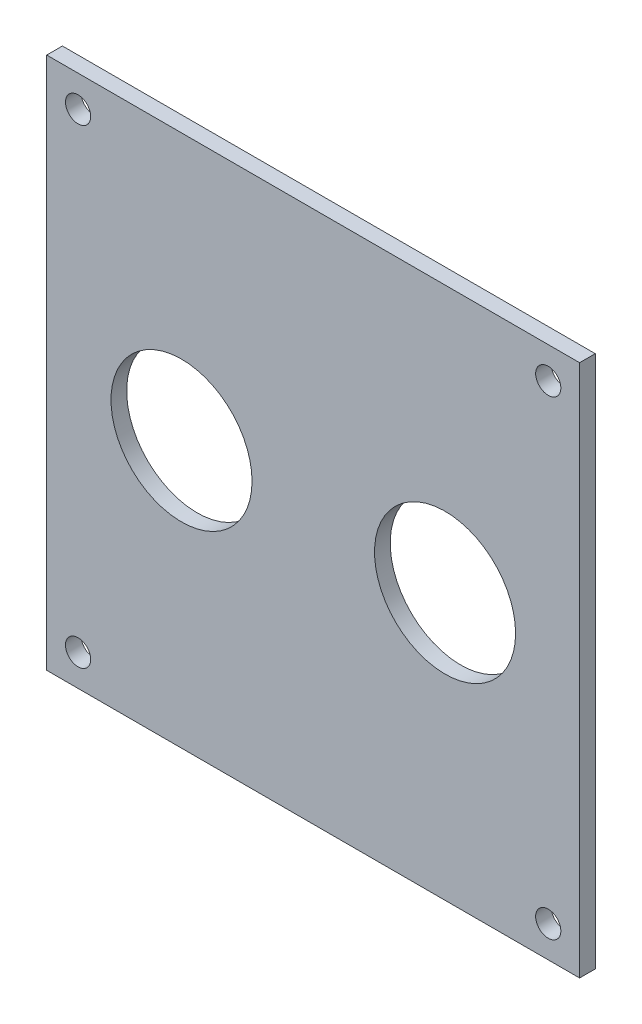
ISO-10303-21;
HEADER;
FILE_DESCRIPTION(('STEP AP214'),'2;1');
FILE_NAME('part.step','',(''),(''),'','','');
FILE_SCHEMA(('AUTOMOTIVE_DESIGN { 1 0 10303 214 1 1 1 1 }'));
ENDSEC;
DATA;
#1=APPLICATION_CONTEXT('core data for automotive mechanical design processes');
#2=APPLICATION_PROTOCOL_DEFINITION('international standard','automotive_design',2000,#1);
#3=PRODUCT_CONTEXT('',#1,'mechanical');
#4=PRODUCT('Part','Part','',(#3));
#5=PRODUCT_RELATED_PRODUCT_CATEGORY('part','',(#4));
#6=PRODUCT_DEFINITION_FORMATION('','',#4);
#7=PRODUCT_DEFINITION_CONTEXT('part definition',#1,'design');
#8=PRODUCT_DEFINITION('design','',#6,#7);
#9=PRODUCT_DEFINITION_SHAPE('','',#8);
#10=(LENGTH_UNIT() NAMED_UNIT(*) SI_UNIT(.MILLI.,.METRE.));
#11=(NAMED_UNIT(*) PLANE_ANGLE_UNIT() SI_UNIT($,.RADIAN.));
#12=(NAMED_UNIT(*) SI_UNIT($,.STERADIAN.) SOLID_ANGLE_UNIT());
#13=UNCERTAINTY_MEASURE_WITH_UNIT(LENGTH_MEASURE(1.E-05),#10,'distance_accuracy_value','');
#14=(GEOMETRIC_REPRESENTATION_CONTEXT(3) GLOBAL_UNCERTAINTY_ASSIGNED_CONTEXT((#13)) GLOBAL_UNIT_ASSIGNED_CONTEXT((#10,
#11,#12)) REPRESENTATION_CONTEXT('',''));
#15=CARTESIAN_POINT('',(0.,0.,0.));
#16=DIRECTION('',(0.,0.,1.));
#17=DIRECTION('',(1.,0.,0.));
#18=AXIS2_PLACEMENT_3D('',#15,#16,#17);
#19=CARTESIAN_POINT('',(0.,0.,3.175));
#20=DIRECTION('',(1.,0.,0.));
#21=DIRECTION('',(0.,0.,-1.));
#22=AXIS2_PLACEMENT_3D('',#19,#20,#21);
#23=PLANE('',#22);
#24=DIRECTION('',(0.,-1.,0.));
#25=VECTOR('',#24,1.);
#26=CARTESIAN_POINT('',(0.,0.,0.));
#27=LINE('',#26,#25);
#28=CARTESIAN_POINT('',(0.,107.95,0.));
#29=VERTEX_POINT('',#28);
#30=CARTESIAN_POINT('',(0.,0.,0.));
#31=VERTEX_POINT('',#30);
#32=EDGE_CURVE('E95',#29,#31,#27,.T.);
#33=ORIENTED_EDGE('',*,*,#32,.T.);
#34=DIRECTION('',(0.,0.,-1.));
#35=VECTOR('',#34,1.);
#36=CARTESIAN_POINT('',(0.,0.,3.175));
#37=LINE('',#36,#35);
#38=CARTESIAN_POINT('',(0.,0.,3.175));
#39=VERTEX_POINT('',#38);
#40=EDGE_CURVE('E11',#39,#31,#37,.T.);
#41=ORIENTED_EDGE('',*,*,#40,.F.);
#42=DIRECTION('',(0.,-1.,0.));
#43=VECTOR('',#42,1.);
#44=CARTESIAN_POINT('',(0.,0.,3.175));
#45=LINE('',#44,#43);
#46=CARTESIAN_POINT('',(0.,107.95,3.175));
#47=VERTEX_POINT('',#46);
#48=EDGE_CURVE('E83',#47,#39,#45,.T.);
#49=ORIENTED_EDGE('',*,*,#48,.F.);
#50=DIRECTION('',(0.,0.,-1.));
#51=VECTOR('',#50,1.);
#52=CARTESIAN_POINT('',(0.,107.95,3.175));
#53=LINE('',#52,#51);
#54=EDGE_CURVE('E91',#47,#29,#53,.T.);
#55=ORIENTED_EDGE('',*,*,#54,.T.);
#56=EDGE_LOOP('',(#33,#41,#49,#55));
#57=FACE_BOUND('',#56,.T.);
#58=ADVANCED_FACE('F32',(#57),#23,.F.);
#59=CARTESIAN_POINT('',(0.,0.,3.175));
#60=DIRECTION('',(0.,1.,0.));
#61=DIRECTION('',(0.,0.,1.));
#62=AXIS2_PLACEMENT_3D('',#59,#60,#61);
#63=PLANE('',#62);
#64=DIRECTION('',(1.,0.,0.));
#65=VECTOR('',#64,1.);
#66=CARTESIAN_POINT('',(0.,0.,0.));
#67=LINE('',#66,#65);
#68=CARTESIAN_POINT('',(107.95,0.,0.));
#69=VERTEX_POINT('',#68);
#70=EDGE_CURVE('E87',#31,#69,#67,.T.);
#71=ORIENTED_EDGE('',*,*,#70,.T.);
#72=DIRECTION('',(0.,0.,-1.));
#73=VECTOR('',#72,1.);
#74=CARTESIAN_POINT('',(107.95,0.,3.175));
#75=LINE('',#74,#73);
#76=CARTESIAN_POINT('',(107.95,0.,3.175));
#77=VERTEX_POINT('',#76);
#78=EDGE_CURVE('E40',#77,#69,#75,.T.);
#79=ORIENTED_EDGE('',*,*,#78,.F.);
#80=DIRECTION('',(1.,0.,0.));
#81=VECTOR('',#80,1.);
#82=CARTESIAN_POINT('',(0.,0.,3.175));
#83=LINE('',#82,#81);
#84=EDGE_CURVE('E78',#39,#77,#83,.T.);
#85=ORIENTED_EDGE('',*,*,#84,.F.);
#86=ORIENTED_EDGE('',*,*,#40,.T.);
#87=EDGE_LOOP('',(#71,#79,#85,#86));
#88=FACE_BOUND('',#87,.T.);
#89=ADVANCED_FACE('F86',(#88),#63,.F.);
#90=CARTESIAN_POINT('',(107.95,0.,3.175));
#91=DIRECTION('',(-1.,0.,0.));
#92=DIRECTION('',(0.,0.,1.));
#93=AXIS2_PLACEMENT_3D('',#90,#91,#92);
#94=PLANE('',#93);
#95=DIRECTION('',(0.,1.,0.));
#96=VECTOR('',#95,1.);
#97=CARTESIAN_POINT('',(107.95,0.,0.));
#98=LINE('',#97,#96);
#99=CARTESIAN_POINT('',(107.95,107.95,0.));
#100=VERTEX_POINT('',#99);
#101=EDGE_CURVE('E65',#69,#100,#98,.T.);
#102=ORIENTED_EDGE('',*,*,#101,.T.);
#103=DIRECTION('',(0.,0.,-1.));
#104=VECTOR('',#103,1.);
#105=CARTESIAN_POINT('',(107.95,107.95,3.175));
#106=LINE('',#105,#104);
#107=CARTESIAN_POINT('',(107.95,107.95,3.175));
#108=VERTEX_POINT('',#107);
#109=EDGE_CURVE('E88',#108,#100,#106,.T.);
#110=ORIENTED_EDGE('',*,*,#109,.F.);
#111=DIRECTION('',(0.,1.,0.));
#112=VECTOR('',#111,1.);
#113=CARTESIAN_POINT('',(107.95,0.,3.175));
#114=LINE('',#113,#112);
#115=EDGE_CURVE('E81',#77,#108,#114,.T.);
#116=ORIENTED_EDGE('',*,*,#115,.F.);
#117=ORIENTED_EDGE('',*,*,#78,.T.);
#118=EDGE_LOOP('',(#102,#110,#116,#117));
#119=FACE_BOUND('',#118,.T.);
#120=ADVANCED_FACE('F89',(#119),#94,.F.);
#121=CARTESIAN_POINT('',(0.,107.95,3.175));
#122=DIRECTION('',(0.,-1.,0.));
#123=DIRECTION('',(0.,0.,-1.));
#124=AXIS2_PLACEMENT_3D('',#121,#122,#123);
#125=PLANE('',#124);
#126=DIRECTION('',(-1.,0.,0.));
#127=VECTOR('',#126,1.);
#128=CARTESIAN_POINT('',(0.,107.95,0.));
#129=LINE('',#128,#127);
#130=EDGE_CURVE('E71',#100,#29,#129,.T.);
#131=ORIENTED_EDGE('',*,*,#130,.T.);
#132=ORIENTED_EDGE('',*,*,#54,.F.);
#133=DIRECTION('',(-1.,0.,0.));
#134=VECTOR('',#133,1.);
#135=CARTESIAN_POINT('',(0.,107.95,3.175));
#136=LINE('',#135,#134);
#137=EDGE_CURVE('E48',#108,#47,#136,.T.);
#138=ORIENTED_EDGE('',*,*,#137,.F.);
#139=ORIENTED_EDGE('',*,*,#109,.T.);
#140=EDGE_LOOP('',(#131,#132,#138,#139));
#141=FACE_BOUND('',#140,.T.);
#142=ADVANCED_FACE('F103',(#141),#125,.F.);
#143=CARTESIAN_POINT('',(0.,0.,3.175));
#144=DIRECTION('',(0.,0.,-1.));
#145=DIRECTION('',(-1.,0.,0.));
#146=AXIS2_PLACEMENT_3D('',#143,#144,#145);
#147=PLANE('',#146);
#148=CARTESIAN_POINT('',(80.6958,53.975,3.175));
#149=DIRECTION('',(0.,0.,1.));
#150=DIRECTION('',(1.,0.,0.));
#151=AXIS2_PLACEMENT_3D('',#148,#149,#150);
#152=CIRCLE('',#151,14.2875);
#153=CARTESIAN_POINT('',(94.9833,53.975,3.175));
#154=VERTEX_POINT('',#153);
#155=EDGE_CURVE('E139',#154,#154,#152,.T.);
#156=ORIENTED_EDGE('',*,*,#155,.F.);
#157=EDGE_LOOP('',(#156));
#158=FACE_BOUND('',#157,.T.);
#159=CARTESIAN_POINT('',(27.305,53.975,3.175));
#160=DIRECTION('',(0.,0.,1.));
#161=DIRECTION('',(1.,0.,0.));
#162=AXIS2_PLACEMENT_3D('',#159,#160,#161);
#163=CIRCLE('',#162,14.2875);
#164=CARTESIAN_POINT('',(41.5925,53.975,3.175));
#165=VERTEX_POINT('',#164);
#166=EDGE_CURVE('E133',#165,#165,#163,.T.);
#167=ORIENTED_EDGE('',*,*,#166,.F.);
#168=EDGE_LOOP('',(#167));
#169=FACE_BOUND('',#168,.T.);
#170=CARTESIAN_POINT('',(6.35,6.34999999999999,3.175));
#171=DIRECTION('',(0.,0.,-1.));
#172=DIRECTION('',(-1.,0.,0.));
#173=AXIS2_PLACEMENT_3D('',#170,#171,#172);
#174=CIRCLE('',#173,2.5527);
#175=CARTESIAN_POINT('',(3.7973,6.34999999999999,3.175));
#176=VERTEX_POINT('',#175);
#177=EDGE_CURVE('E124',#176,#176,#174,.T.);
#178=ORIENTED_EDGE('',*,*,#177,.T.);
#179=EDGE_LOOP('',(#178));
#180=FACE_BOUND('',#179,.T.);
#181=CARTESIAN_POINT('',(101.6,6.35,3.175));
#182=DIRECTION('',(0.,0.,-1.));
#183=DIRECTION('',(-1.,0.,0.));
#184=AXIS2_PLACEMENT_3D('',#181,#182,#183);
#185=CIRCLE('',#184,2.55270000000001);
#186=CARTESIAN_POINT('',(99.0473,6.35,3.175));
#187=VERTEX_POINT('',#186);
#188=EDGE_CURVE('E118',#187,#187,#185,.T.);
#189=ORIENTED_EDGE('',*,*,#188,.T.);
#190=EDGE_LOOP('',(#189));
#191=FACE_BOUND('',#190,.T.);
#192=CARTESIAN_POINT('',(101.6,101.6,3.175));
#193=DIRECTION('',(0.,0.,-1.));
#194=DIRECTION('',(-1.,0.,0.));
#195=AXIS2_PLACEMENT_3D('',#192,#193,#194);
#196=CIRCLE('',#195,2.55270000000003);
#197=CARTESIAN_POINT('',(99.0473,101.6,3.175));
#198=VERTEX_POINT('',#197);
#199=EDGE_CURVE('E112',#198,#198,#196,.T.);
#200=ORIENTED_EDGE('',*,*,#199,.T.);
#201=EDGE_LOOP('',(#200));
#202=FACE_BOUND('',#201,.T.);
#203=CARTESIAN_POINT('',(6.35,101.6,3.175));
#204=DIRECTION('',(0.,0.,-1.));
#205=DIRECTION('',(-1.,0.,0.));
#206=AXIS2_PLACEMENT_3D('',#203,#204,#205);
#207=CIRCLE('',#206,2.5527);
#208=CARTESIAN_POINT('',(3.7973,101.6,3.175));
#209=VERTEX_POINT('',#208);
#210=EDGE_CURVE('E98',#209,#209,#207,.T.);
#211=ORIENTED_EDGE('',*,*,#210,.T.);
#212=EDGE_LOOP('',(#211));
#213=FACE_BOUND('',#212,.T.);
#214=ORIENTED_EDGE('',*,*,#48,.T.);
#215=ORIENTED_EDGE('',*,*,#84,.T.);
#216=ORIENTED_EDGE('',*,*,#115,.T.);
#217=ORIENTED_EDGE('',*,*,#137,.T.);
#218=EDGE_LOOP('',(#214,#215,#216,#217));
#219=FACE_BOUND('',#218,.T.);
#220=ADVANCED_FACE('F79',(#158,#169,#180,#191,#202,#213,#219),#147,.F.);
#221=CARTESIAN_POINT('',(0.,0.,0.));
#222=DIRECTION('',(0.,0.,-1.));
#223=DIRECTION('',(-1.,0.,0.));
#224=AXIS2_PLACEMENT_3D('',#221,#222,#223);
#225=PLANE('',#224);
#226=CARTESIAN_POINT('',(80.6958,53.975,0.));
#227=DIRECTION('',(0.,0.,1.));
#228=DIRECTION('',(1.,0.,0.));
#229=AXIS2_PLACEMENT_3D('',#226,#227,#228);
#230=CIRCLE('',#229,14.2875);
#231=CARTESIAN_POINT('',(94.9833,53.975,0.));
#232=VERTEX_POINT('',#231);
#233=EDGE_CURVE('E136',#232,#232,#230,.T.);
#234=ORIENTED_EDGE('',*,*,#233,.T.);
#235=EDGE_LOOP('',(#234));
#236=FACE_BOUND('',#235,.T.);
#237=CARTESIAN_POINT('',(27.305,53.975,0.));
#238=DIRECTION('',(0.,0.,1.));
#239=DIRECTION('',(1.,0.,0.));
#240=AXIS2_PLACEMENT_3D('',#237,#238,#239);
#241=CIRCLE('',#240,14.2875);
#242=CARTESIAN_POINT('',(41.5925,53.975,0.));
#243=VERTEX_POINT('',#242);
#244=EDGE_CURVE('E130',#243,#243,#241,.T.);
#245=ORIENTED_EDGE('',*,*,#244,.T.);
#246=EDGE_LOOP('',(#245));
#247=FACE_BOUND('',#246,.T.);
#248=CARTESIAN_POINT('',(6.35,6.34999999999999,0.));
#249=DIRECTION('',(0.,0.,-1.));
#250=DIRECTION('',(-1.,0.,0.));
#251=AXIS2_PLACEMENT_3D('',#248,#249,#250);
#252=CIRCLE('',#251,2.5527);
#253=CARTESIAN_POINT('',(3.7973,6.34999999999999,0.));
#254=VERTEX_POINT('',#253);
#255=EDGE_CURVE('E127',#254,#254,#252,.T.);
#256=ORIENTED_EDGE('',*,*,#255,.F.);
#257=EDGE_LOOP('',(#256));
#258=FACE_BOUND('',#257,.T.);
#259=CARTESIAN_POINT('',(101.6,6.35,0.));
#260=DIRECTION('',(0.,0.,-1.));
#261=DIRECTION('',(-1.,0.,0.));
#262=AXIS2_PLACEMENT_3D('',#259,#260,#261);
#263=CIRCLE('',#262,2.55270000000001);
#264=CARTESIAN_POINT('',(99.0473,6.35,0.));
#265=VERTEX_POINT('',#264);
#266=EDGE_CURVE('E121',#265,#265,#263,.T.);
#267=ORIENTED_EDGE('',*,*,#266,.F.);
#268=EDGE_LOOP('',(#267));
#269=FACE_BOUND('',#268,.T.);
#270=CARTESIAN_POINT('',(101.6,101.6,0.));
#271=DIRECTION('',(0.,0.,-1.));
#272=DIRECTION('',(-1.,0.,0.));
#273=AXIS2_PLACEMENT_3D('',#270,#271,#272);
#274=CIRCLE('',#273,2.55270000000003);
#275=CARTESIAN_POINT('',(99.0473,101.6,0.));
#276=VERTEX_POINT('',#275);
#277=EDGE_CURVE('E115',#276,#276,#274,.T.);
#278=ORIENTED_EDGE('',*,*,#277,.F.);
#279=EDGE_LOOP('',(#278));
#280=FACE_BOUND('',#279,.T.);
#281=CARTESIAN_POINT('',(6.35,101.6,0.));
#282=DIRECTION('',(0.,0.,-1.));
#283=DIRECTION('',(-1.,0.,0.));
#284=AXIS2_PLACEMENT_3D('',#281,#282,#283);
#285=CIRCLE('',#284,2.5527);
#286=CARTESIAN_POINT('',(3.7973,101.6,0.));
#287=VERTEX_POINT('',#286);
#288=EDGE_CURVE('E109',#287,#287,#285,.T.);
#289=ORIENTED_EDGE('',*,*,#288,.F.);
#290=EDGE_LOOP('',(#289));
#291=FACE_BOUND('',#290,.T.);
#292=ORIENTED_EDGE('',*,*,#32,.F.);
#293=ORIENTED_EDGE('',*,*,#130,.F.);
#294=ORIENTED_EDGE('',*,*,#101,.F.);
#295=ORIENTED_EDGE('',*,*,#70,.F.);
#296=EDGE_LOOP('',(#292,#293,#294,#295));
#297=FACE_BOUND('',#296,.T.);
#298=ADVANCED_FACE('F106',(#236,#247,#258,#269,#280,#291,#297),#225,.T.);
#299=CARTESIAN_POINT('',(6.35,101.6,3.175));
#300=DIRECTION('',(0.,0.,-1.));
#301=DIRECTION('',(-1.,0.,0.));
#302=AXIS2_PLACEMENT_3D('',#299,#300,#301);
#303=CYLINDRICAL_SURFACE('',#302,2.5527);
#304=ORIENTED_EDGE('',*,*,#210,.F.);
#305=EDGE_LOOP('',(#304));
#306=FACE_BOUND('',#305,.T.);
#307=ORIENTED_EDGE('',*,*,#288,.T.);
#308=EDGE_LOOP('',(#307));
#309=FACE_BOUND('',#308,.T.);
#310=ADVANCED_FACE('F167',(#306,#309),#303,.F.);
#311=CARTESIAN_POINT('',(101.6,101.6,3.175));
#312=DIRECTION('',(0.,0.,-1.));
#313=DIRECTION('',(-1.,0.,0.));
#314=AXIS2_PLACEMENT_3D('',#311,#312,#313);
#315=CYLINDRICAL_SURFACE('',#314,2.55270000000003);
#316=ORIENTED_EDGE('',*,*,#199,.F.);
#317=EDGE_LOOP('',(#316));
#318=FACE_BOUND('',#317,.T.);
#319=ORIENTED_EDGE('',*,*,#277,.T.);
#320=EDGE_LOOP('',(#319));
#321=FACE_BOUND('',#320,.T.);
#322=ADVANCED_FACE('F170',(#318,#321),#315,.F.);
#323=CARTESIAN_POINT('',(101.6,6.35,3.175));
#324=DIRECTION('',(0.,0.,-1.));
#325=DIRECTION('',(-1.,0.,0.));
#326=AXIS2_PLACEMENT_3D('',#323,#324,#325);
#327=CYLINDRICAL_SURFACE('',#326,2.55270000000001);
#328=ORIENTED_EDGE('',*,*,#188,.F.);
#329=EDGE_LOOP('',(#328));
#330=FACE_BOUND('',#329,.T.);
#331=ORIENTED_EDGE('',*,*,#266,.T.);
#332=EDGE_LOOP('',(#331));
#333=FACE_BOUND('',#332,.T.);
#334=ADVANCED_FACE('F214',(#330,#333),#327,.F.);
#335=CARTESIAN_POINT('',(6.35,6.34999999999999,3.175));
#336=DIRECTION('',(0.,0.,-1.));
#337=DIRECTION('',(-1.,0.,0.));
#338=AXIS2_PLACEMENT_3D('',#335,#336,#337);
#339=CYLINDRICAL_SURFACE('',#338,2.5527);
#340=ORIENTED_EDGE('',*,*,#177,.F.);
#341=EDGE_LOOP('',(#340));
#342=FACE_BOUND('',#341,.T.);
#343=ORIENTED_EDGE('',*,*,#255,.T.);
#344=EDGE_LOOP('',(#343));
#345=FACE_BOUND('',#344,.T.);
#346=ADVANCED_FACE('F222',(#342,#345),#339,.F.);
#347=CARTESIAN_POINT('',(27.305,53.975,0.));
#348=DIRECTION('',(0.,0.,1.));
#349=DIRECTION('',(1.,0.,0.));
#350=AXIS2_PLACEMENT_3D('',#347,#348,#349);
#351=CYLINDRICAL_SURFACE('',#350,14.2875);
#352=ORIENTED_EDGE('',*,*,#244,.F.);
#353=EDGE_LOOP('',(#352));
#354=FACE_BOUND('',#353,.T.);
#355=ORIENTED_EDGE('',*,*,#166,.T.);
#356=EDGE_LOOP('',(#355));
#357=FACE_BOUND('',#356,.T.);
#358=ADVANCED_FACE('F150',(#354,#357),#351,.F.);
#359=CARTESIAN_POINT('',(80.6958,53.975,0.));
#360=DIRECTION('',(0.,0.,1.));
#361=DIRECTION('',(1.,0.,0.));
#362=AXIS2_PLACEMENT_3D('',#359,#360,#361);
#363=CYLINDRICAL_SURFACE('',#362,14.2875);
#364=ORIENTED_EDGE('',*,*,#233,.F.);
#365=EDGE_LOOP('',(#364));
#366=FACE_BOUND('',#365,.T.);
#367=ORIENTED_EDGE('',*,*,#155,.T.);
#368=EDGE_LOOP('',(#367));
#369=FACE_BOUND('',#368,.T.);
#370=ADVANCED_FACE('F147',(#366,#369),#363,.F.);
#371=CLOSED_SHELL('',(#58,#89,#120,#142,#220,#298,#310,#322,#334,#346,#358,#370));
#372=MANIFOLD_SOLID_BREP('B2',#371);
#373=ADVANCED_BREP_SHAPE_REPRESENTATION('',(#18,#372),#14);
#374=SHAPE_DEFINITION_REPRESENTATION(#9,#373);
ENDSEC;
END-ISO-10303-21;
